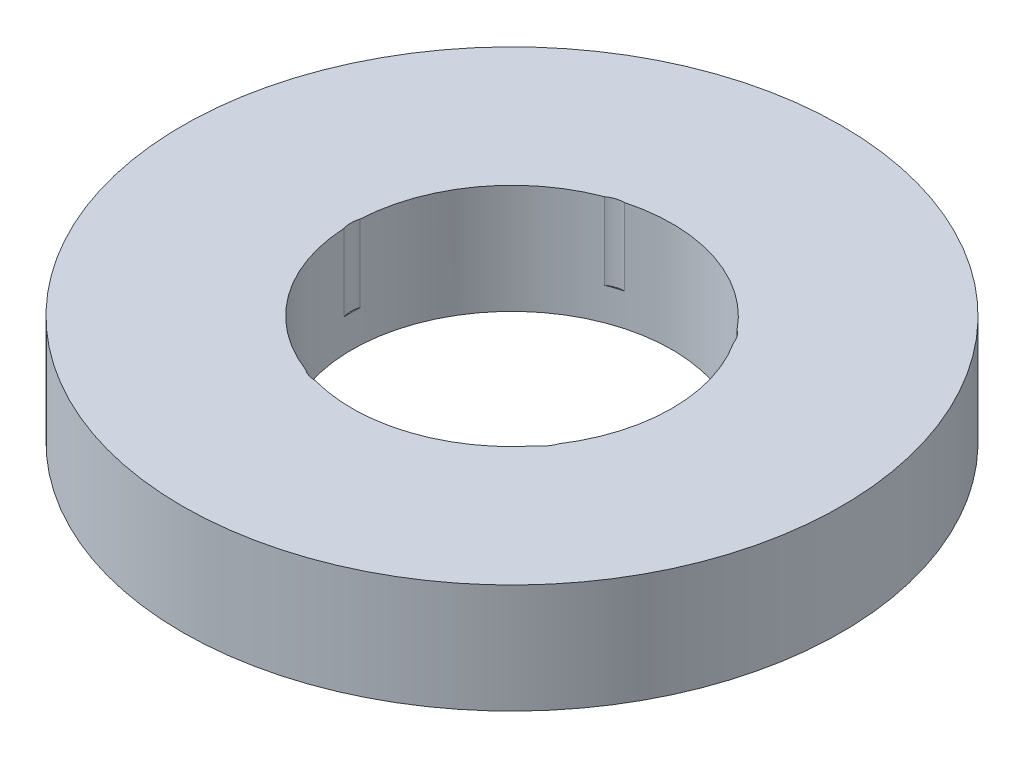
ISO-10303-21;
HEADER;
FILE_DESCRIPTION(('STEP AP214'),'2;1');
FILE_NAME('part.step','',(''),(''),'','','');
FILE_SCHEMA(('AUTOMOTIVE_DESIGN { 1 0 10303 214 1 1 1 1 }'));
ENDSEC;
DATA;
#1=APPLICATION_CONTEXT('core data for automotive mechanical design processes');
#2=APPLICATION_PROTOCOL_DEFINITION('international standard','automotive_design',2000,#1);
#3=PRODUCT_CONTEXT('',#1,'mechanical');
#4=PRODUCT('Part','Part','',(#3));
#5=PRODUCT_RELATED_PRODUCT_CATEGORY('part','',(#4));
#6=PRODUCT_DEFINITION_FORMATION('','',#4);
#7=PRODUCT_DEFINITION_CONTEXT('part definition',#1,'design');
#8=PRODUCT_DEFINITION('design','',#6,#7);
#9=PRODUCT_DEFINITION_SHAPE('','',#8);
#10=(LENGTH_UNIT() NAMED_UNIT(*) SI_UNIT(.MILLI.,.METRE.));
#11=(NAMED_UNIT(*) PLANE_ANGLE_UNIT() SI_UNIT($,.RADIAN.));
#12=(NAMED_UNIT(*) SI_UNIT($,.STERADIAN.) SOLID_ANGLE_UNIT());
#13=UNCERTAINTY_MEASURE_WITH_UNIT(LENGTH_MEASURE(1.E-05),#10,'distance_accuracy_value','');
#14=(GEOMETRIC_REPRESENTATION_CONTEXT(3) GLOBAL_UNCERTAINTY_ASSIGNED_CONTEXT((#13)) GLOBAL_UNIT_ASSIGNED_CONTEXT((#10,
#11,#12)) REPRESENTATION_CONTEXT('',''));
#15=CARTESIAN_POINT('',(0.,0.,0.));
#16=DIRECTION('',(0.,0.,1.));
#17=DIRECTION('',(1.,0.,0.));
#18=AXIS2_PLACEMENT_3D('',#15,#16,#17);
#19=CARTESIAN_POINT('',(0.,29.,0.));
#20=DIRECTION('',(0.,-1.,0.));
#21=DIRECTION('',(0.,0.,-1.));
#22=AXIS2_PLACEMENT_3D('',#19,#20,#21);
#23=CYLINDRICAL_SURFACE('',#22,87.5);
#24=CARTESIAN_POINT('',(0.,29.,0.));
#25=DIRECTION('',(0.,1.,0.));
#26=DIRECTION('',(0.,0.,1.));
#27=AXIS2_PLACEMENT_3D('',#24,#25,#26);
#28=CIRCLE('',#27,87.5);
#29=CARTESIAN_POINT('',(0.,29.,-87.5));
#30=VERTEX_POINT('',#29);
#31=EDGE_CURVE('E151',#30,#30,#28,.T.);
#32=CARTESIAN_POINT('',(0.,0.,0.));
#33=DIRECTION('',(0.,1.,0.));
#34=DIRECTION('',(0.,0.,1.));
#35=AXIS2_PLACEMENT_3D('',#32,#33,#34);
#36=CIRCLE('',#35,87.5);
#37=CARTESIAN_POINT('',(0.,0.,-87.5));
#38=VERTEX_POINT('',#37);
#39=EDGE_CURVE('E150',#38,#38,#36,.T.);
#40=CARTESIAN_POINT('',(0.,29.,-87.5));
#41=CARTESIAN_POINT('',(0.,28.6979166666667,-87.5));
#42=CARTESIAN_POINT('',(0.,28.3958333333333,-87.5));
#43=CARTESIAN_POINT('',(0.,27.7916666666667,-87.5));
#44=CARTESIAN_POINT('',(0.,27.4895833333333,-87.5));
#45=CARTESIAN_POINT('',(0.,26.8854166666667,-87.5));
#46=CARTESIAN_POINT('',(0.,26.5833333333333,-87.5));
#47=CARTESIAN_POINT('',(0.,25.9791666666667,-87.5));
#48=CARTESIAN_POINT('',(0.,25.6770833333333,-87.5));
#49=CARTESIAN_POINT('',(0.,25.0729166666667,-87.5));
#50=CARTESIAN_POINT('',(0.,24.7708333333333,-87.5));
#51=CARTESIAN_POINT('',(0.,24.1666666666667,-87.5));
#52=CARTESIAN_POINT('',(0.,23.8645833333333,-87.5));
#53=CARTESIAN_POINT('',(0.,23.2604166666667,-87.5));
#54=CARTESIAN_POINT('',(0.,22.9583333333333,-87.5));
#55=CARTESIAN_POINT('',(0.,22.3541666666667,-87.5));
#56=CARTESIAN_POINT('',(0.,22.0520833333333,-87.5));
#57=CARTESIAN_POINT('',(0.,21.4479166666667,-87.5));
#58=CARTESIAN_POINT('',(0.,21.1458333333333,-87.5));
#59=CARTESIAN_POINT('',(0.,20.5416666666667,-87.5));
#60=CARTESIAN_POINT('',(0.,20.2395833333333,-87.5));
#61=CARTESIAN_POINT('',(0.,19.6354166666667,-87.5));
#62=CARTESIAN_POINT('',(0.,19.3333333333333,-87.5));
#63=CARTESIAN_POINT('',(0.,18.7291666666667,-87.5));
#64=CARTESIAN_POINT('',(0.,18.4270833333333,-87.5));
#65=CARTESIAN_POINT('',(0.,17.8229166666667,-87.5));
#66=CARTESIAN_POINT('',(0.,17.5208333333333,-87.5));
#67=CARTESIAN_POINT('',(0.,16.9166666666667,-87.5));
#68=CARTESIAN_POINT('',(0.,16.6145833333333,-87.5));
#69=CARTESIAN_POINT('',(0.,16.0104166666667,-87.5));
#70=CARTESIAN_POINT('',(0.,15.7083333333333,-87.5));
#71=CARTESIAN_POINT('',(0.,15.1041666666667,-87.5));
#72=CARTESIAN_POINT('',(0.,14.8020833333333,-87.5));
#73=CARTESIAN_POINT('',(0.,14.1979166666667,-87.5));
#74=CARTESIAN_POINT('',(0.,13.8958333333333,-87.5));
#75=CARTESIAN_POINT('',(0.,13.2916666666667,-87.5));
#76=CARTESIAN_POINT('',(0.,12.9895833333333,-87.5));
#77=CARTESIAN_POINT('',(0.,12.3854166666667,-87.5));
#78=CARTESIAN_POINT('',(0.,12.0833333333333,-87.5));
#79=CARTESIAN_POINT('',(0.,11.4791666666667,-87.5));
#80=CARTESIAN_POINT('',(0.,11.1770833333333,-87.5));
#81=CARTESIAN_POINT('',(0.,10.5729166666667,-87.5));
#82=CARTESIAN_POINT('',(0.,10.2708333333333,-87.5));
#83=CARTESIAN_POINT('',(0.,9.66666666666667,-87.5));
#84=CARTESIAN_POINT('',(0.,9.36458333333333,-87.5));
#85=CARTESIAN_POINT('',(0.,8.76041666666667,-87.5));
#86=CARTESIAN_POINT('',(0.,8.45833333333333,-87.5));
#87=CARTESIAN_POINT('',(0.,7.85416666666667,-87.5));
#88=CARTESIAN_POINT('',(0.,7.55208333333333,-87.5));
#89=CARTESIAN_POINT('',(0.,6.94791666666667,-87.5));
#90=CARTESIAN_POINT('',(0.,6.64583333333333,-87.5));
#91=CARTESIAN_POINT('',(0.,6.04166666666667,-87.5));
#92=CARTESIAN_POINT('',(0.,5.73958333333333,-87.5));
#93=CARTESIAN_POINT('',(0.,5.13541666666667,-87.5));
#94=CARTESIAN_POINT('',(0.,4.83333333333333,-87.5));
#95=CARTESIAN_POINT('',(0.,4.22916666666667,-87.5));
#96=CARTESIAN_POINT('',(0.,3.92708333333333,-87.5));
#97=CARTESIAN_POINT('',(0.,3.32291666666667,-87.5));
#98=CARTESIAN_POINT('',(0.,3.02083333333333,-87.5));
#99=CARTESIAN_POINT('',(0.,2.41666666666667,-87.5));
#100=CARTESIAN_POINT('',(0.,2.11458333333333,-87.5));
#101=CARTESIAN_POINT('',(0.,1.51041666666667,-87.5));
#102=CARTESIAN_POINT('',(0.,1.20833333333333,-87.5));
#103=CARTESIAN_POINT('',(0.,0.604166666666667,-87.5));
#104=CARTESIAN_POINT('',(0.,0.302083333333333,-87.5));
#105=CARTESIAN_POINT('',(0.,0.,-87.5));
#106=B_SPLINE_CURVE_WITH_KNOTS('',3,(#40,#41,#42,#43,#44,#45,#46,#47,#48,#49,#50,#51,#52,#53,
#54,#55,#56,#57,#58,#59,#60,#61,#62,#63,#64,#65,#66,#67,#68,#69,#70,#71,#72,#73,#74,#75,#76,#77,
#78,#79,#80,#81,#82,#83,#84,#85,#86,#87,#88,#89,#90,#91,#92,#93,#94,#95,#96,#97,#98,#99,#100,
#101,#102,#103,#104,#105),.UNSPECIFIED.,.F.,.F.,(4,2,2,2,2,2,2,2,2,2,2,2,2,2,2,2,2,2,2,2,2,2,2,
2,2,2,2,2,2,2,2,2,4),(0.,0.906249999999997,1.8125,2.71875,3.625,4.53125,5.4375,6.34375,7.25,
8.15625,9.0625,9.96875,10.875,11.78125,12.6875,13.59375,14.5,15.40625,16.3125,17.21875,18.125,
19.03125,19.9375,20.84375,21.75,22.65625,23.5625,24.46875,25.375,26.28125,27.1875,28.09375,29.),.UNSPECIFIED.);
#107=EDGE_CURVE('BSEAM39',#30,#38,#106,.T.);
#108=ORIENTED_EDGE('',*,*,#31,.F.);
#109=ORIENTED_EDGE('',*,*,#39,.T.);
#110=ORIENTED_EDGE('',*,*,#107,.T.);
#111=ORIENTED_EDGE('',*,*,#107,.F.);
#112=EDGE_LOOP('',(#108,#110,#109,#111));
#113=FACE_BOUND('',#112,.T.);
#114=ADVANCED_FACE('F39',(#113),#23,.T.);
#115=CARTESIAN_POINT('',(0.,29.,0.));
#116=DIRECTION('',(0.,1.,0.));
#117=DIRECTION('',(0.,0.,1.));
#118=AXIS2_PLACEMENT_3D('',#115,#116,#117);
#119=PLANE('',#118);
#120=CARTESIAN_POINT('',(-11.0575258111567,29.,-34.0315651508861));
#121=DIRECTION('',(0.,1.,0.));
#122=DIRECTION('',(-0.95105651629515,0.,0.309016994374958));
#123=AXIS2_PLACEMENT_3D('',#120,#121,#122);
#124=CIRCLE('',#123,6.99416416466977);
#125=CARTESIAN_POINT('',(-11.0972423041203,29.,-41.0256165492201));
#126=VERTEX_POINT('',#125);
#127=CARTESIAN_POINT('',(-15.1363947591085,29.,-39.7132163605069));
#128=VERTEX_POINT('',#127);
#129=EDGE_CURVE('E196',#126,#128,#124,.T.);
#130=ORIENTED_EDGE('',*,*,#129,.F.);
#131=CARTESIAN_POINT('',(0.,29.,0.));
#132=DIRECTION('',(0.,1.,0.));
#133=DIRECTION('',(0.,0.,1.));
#134=AXIS2_PLACEMENT_3D('',#131,#132,#133);
#135=CIRCLE('',#134,42.5);
#136=CARTESIAN_POINT('',(33.092109988567,29.,-26.6676256255517));
#137=VERTEX_POINT('',#136);
#138=EDGE_CURVE('E156',#137,#126,#135,.T.);
#139=ORIENTED_EDGE('',*,*,#138,.F.);
#140=CARTESIAN_POINT('',(28.9489784050863,29.,-21.0326639536044));
#141=DIRECTION('',(0.,1.,0.));
#142=DIRECTION('',(-0.58778525229248,0.,-0.809016994374942));
#143=AXIS2_PLACEMENT_3D('',#140,#141,#142);
#144=CIRCLE('',#143,6.99416416466977);
#145=CARTESIAN_POINT('',(35.5884434914923,29.,-23.2317173246589));
#146=VERTEX_POINT('',#145);
#147=EDGE_CURVE('E254',#146,#137,#144,.T.);
#148=ORIENTED_EDGE('',*,*,#147,.F.);
#149=CARTESIAN_POINT('',(35.5884434914927,29.,23.2317173246584));
#150=VERTEX_POINT('',#149);
#151=EDGE_CURVE('E153',#150,#146,#135,.T.);
#152=ORIENTED_EDGE('',*,*,#151,.F.);
#153=CARTESIAN_POINT('',(28.9489784050866,29.,21.032663953604));
#154=DIRECTION('',(0.,1.,0.));
#155=DIRECTION('',(0.587785252292469,0.,-0.809016994374951));
#156=AXIS2_PLACEMENT_3D('',#153,#154,#155);
#157=CIRCLE('',#156,6.99416416466977);
#158=CARTESIAN_POINT('',(33.0921099885674,29.,26.6676256255513));
#159=VERTEX_POINT('',#158);
#160=EDGE_CURVE('E248',#159,#150,#157,.T.);
#161=ORIENTED_EDGE('',*,*,#160,.F.);
#162=CARTESIAN_POINT('',(-11.0972423041197,29.,41.0256165492203));
#163=VERTEX_POINT('',#162);
#164=EDGE_CURVE('E140',#163,#159,#135,.T.);
#165=ORIENTED_EDGE('',*,*,#164,.F.);
#166=CARTESIAN_POINT('',(-11.0575258111562,29.,34.0315651508863));
#167=DIRECTION('',(0.,1.,0.));
#168=DIRECTION('',(0.951056516295155,0.,0.309016994374945));
#169=AXIS2_PLACEMENT_3D('',#166,#167,#168);
#170=CIRCLE('',#169,6.99416416466977);
#171=CARTESIAN_POINT('',(-15.136394759108,29.,39.7132163605071));
#172=VERTEX_POINT('',#171);
#173=EDGE_CURVE('E117',#172,#163,#170,.T.);
#174=ORIENTED_EDGE('',*,*,#173,.F.);
#175=CARTESIAN_POINT('',(-42.4469164168318,29.,2.12350811217969));
#176=VERTEX_POINT('',#175);
#177=EDGE_CURVE('E133',#176,#172,#135,.T.);
#178=ORIENTED_EDGE('',*,*,#177,.F.);
#179=CARTESIAN_POINT('',(-35.7829051878604,29.,0.));
#180=DIRECTION('',(0.,1.,0.));
#181=DIRECTION('',(0.,0.,1.));
#182=AXIS2_PLACEMENT_3D('',#179,#180,#181);
#183=CIRCLE('',#182,6.99416416466977);
#184=CARTESIAN_POINT('',(-42.4469164168318,29.,-2.12350811217969));
#185=VERTEX_POINT('',#184);
#186=EDGE_CURVE('E170',#185,#176,#183,.T.);
#187=ORIENTED_EDGE('',*,*,#186,.F.);
#188=EDGE_CURVE('E149',#128,#185,#135,.T.);
#189=ORIENTED_EDGE('',*,*,#188,.F.);
#190=EDGE_LOOP('',(#130,#139,#148,#152,#161,#165,#174,#178,#187,#189));
#191=FACE_BOUND('',#190,.T.);
#192=ORIENTED_EDGE('',*,*,#31,.T.);
#193=EDGE_LOOP('',(#192));
#194=FACE_BOUND('',#193,.T.);
#195=ADVANCED_FACE('F131',(#191,#194),#119,.T.);
#196=CARTESIAN_POINT('',(0.,0.,0.));
#197=DIRECTION('',(0.,1.,0.));
#198=DIRECTION('',(0.,0.,1.));
#199=AXIS2_PLACEMENT_3D('',#196,#197,#198);
#200=PLANE('',#199);
#201=CARTESIAN_POINT('',(0.,0.,0.));
#202=DIRECTION('',(0.,1.,0.));
#203=DIRECTION('',(0.,0.,1.));
#204=AXIS2_PLACEMENT_3D('',#201,#202,#203);
#205=CIRCLE('',#204,42.5);
#206=CARTESIAN_POINT('',(0.,0.,42.5));
#207=VERTEX_POINT('',#206);
#208=EDGE_CURVE('E160',#207,#207,#205,.T.);
#209=ORIENTED_EDGE('',*,*,#208,.T.);
#210=EDGE_LOOP('',(#209));
#211=FACE_BOUND('',#210,.T.);
#212=ORIENTED_EDGE('',*,*,#39,.F.);
#213=EDGE_LOOP('',(#212));
#214=FACE_BOUND('',#213,.T.);
#215=ADVANCED_FACE('F212',(#211,#214),#200,.F.);
#216=CARTESIAN_POINT('',(0.,29.,0.));
#217=DIRECTION('',(0.,-1.,0.));
#218=DIRECTION('',(0.,0.,-1.));
#219=AXIS2_PLACEMENT_3D('',#216,#217,#218);
#220=CYLINDRICAL_SURFACE('',#219,42.5);
#221=DIRECTION('',(0.,1.,0.));
#222=VECTOR('',#221,1.);
#223=CARTESIAN_POINT('',(-11.0972423041203,18.8211931493955,-41.0256165492201));
#224=LINE('',#223,#222);
#225=CARTESIAN_POINT('',(-11.0972423041203,8.64238629879107,-41.0256165492201));
#226=VERTEX_POINT('',#225);
#227=EDGE_CURVE('E11',#226,#126,#224,.T.);
#228=ORIENTED_EDGE('',*,*,#227,.F.);
#229=CARTESIAN_POINT('',(0.,8.64238629879107,0.));
#230=DIRECTION('',(0.,1.,0.));
#231=DIRECTION('',(0.,0.,1.));
#232=AXIS2_PLACEMENT_3D('',#229,#230,#231);
#233=CIRCLE('',#232,42.5);
#234=CARTESIAN_POINT('',(-15.1363947591085,8.64238629879107,-39.7132163605069));
#235=VERTEX_POINT('',#234);
#236=EDGE_CURVE('E193',#226,#235,#233,.T.);
#237=ORIENTED_EDGE('',*,*,#236,.T.);
#238=DIRECTION('',(0.,1.,0.));
#239=VECTOR('',#238,1.);
#240=CARTESIAN_POINT('',(-15.1363947591085,18.8211931493955,-39.7132163605069));
#241=LINE('',#240,#239);
#242=EDGE_CURVE('E46',#128,#235,#241,.F.);
#243=ORIENTED_EDGE('',*,*,#242,.F.);
#244=ORIENTED_EDGE('',*,*,#188,.T.);
#245=DIRECTION('',(0.,1.,0.));
#246=VECTOR('',#245,1.);
#247=CARTESIAN_POINT('',(-42.4469164168318,18.8211931493955,-2.12350811217968));
#248=LINE('',#247,#246);
#249=CARTESIAN_POINT('',(-42.4469164168318,8.64238629879107,-2.12350811217969));
#250=VERTEX_POINT('',#249);
#251=EDGE_CURVE('E174',#250,#185,#248,.T.);
#252=ORIENTED_EDGE('',*,*,#251,.F.);
#253=CARTESIAN_POINT('',(0.,8.64238629879107,0.));
#254=DIRECTION('',(0.,1.,0.));
#255=DIRECTION('',(0.,0.,1.));
#256=AXIS2_PLACEMENT_3D('',#253,#254,#255);
#257=CIRCLE('',#256,42.5);
#258=CARTESIAN_POINT('',(-42.4469164168318,8.64238629879107,2.12350811217969));
#259=VERTEX_POINT('',#258);
#260=EDGE_CURVE('E171',#250,#259,#257,.T.);
#261=ORIENTED_EDGE('',*,*,#260,.T.);
#262=DIRECTION('',(0.,1.,0.));
#263=VECTOR('',#262,1.);
#264=CARTESIAN_POINT('',(-42.4469164168318,18.8211931493955,2.12350811217968));
#265=LINE('',#264,#263);
#266=EDGE_CURVE('E148',#176,#259,#265,.F.);
#267=ORIENTED_EDGE('',*,*,#266,.F.);
#268=ORIENTED_EDGE('',*,*,#177,.T.);
#269=DIRECTION('',(0.,1.,0.));
#270=VECTOR('',#269,1.);
#271=CARTESIAN_POINT('',(-15.136394759108,18.8211931493955,39.7132163605071));
#272=LINE('',#271,#270);
#273=CARTESIAN_POINT('',(-15.136394759108,8.64238629879107,39.7132163605071));
#274=VERTEX_POINT('',#273);
#275=EDGE_CURVE('E111',#274,#172,#272,.T.);
#276=ORIENTED_EDGE('',*,*,#275,.F.);
#277=CARTESIAN_POINT('',(0.,8.64238629879107,0.));
#278=DIRECTION('',(0.,1.,0.));
#279=DIRECTION('',(0.,0.,1.));
#280=AXIS2_PLACEMENT_3D('',#277,#278,#279);
#281=CIRCLE('',#280,42.5);
#282=CARTESIAN_POINT('',(-11.0972423041197,8.64238629879107,41.0256165492203));
#283=VERTEX_POINT('',#282);
#284=EDGE_CURVE('E180',#274,#283,#281,.T.);
#285=ORIENTED_EDGE('',*,*,#284,.T.);
#286=DIRECTION('',(0.,1.,0.));
#287=VECTOR('',#286,1.);
#288=CARTESIAN_POINT('',(-11.0972423041198,18.8211931493955,41.0256165492203));
#289=LINE('',#288,#287);
#290=EDGE_CURVE('E124',#163,#283,#289,.F.);
#291=ORIENTED_EDGE('',*,*,#290,.F.);
#292=ORIENTED_EDGE('',*,*,#164,.T.);
#293=DIRECTION('',(0.,1.,0.));
#294=VECTOR('',#293,1.);
#295=CARTESIAN_POINT('',(33.0921099885674,18.8211931493955,26.6676256255513));
#296=LINE('',#295,#294);
#297=CARTESIAN_POINT('',(33.0921099885674,8.64238629879107,26.6676256255513));
#298=VERTEX_POINT('',#297);
#299=EDGE_CURVE('E183',#298,#159,#296,.T.);
#300=ORIENTED_EDGE('',*,*,#299,.F.);
#301=CARTESIAN_POINT('',(0.,8.64238629879107,0.));
#302=DIRECTION('',(0.,1.,0.));
#303=DIRECTION('',(0.,0.,1.));
#304=AXIS2_PLACEMENT_3D('',#301,#302,#303);
#305=CIRCLE('',#304,42.5);
#306=CARTESIAN_POINT('',(35.5884434914927,8.64238629879107,23.2317173246584));
#307=VERTEX_POINT('',#306);
#308=EDGE_CURVE('E123',#298,#307,#305,.T.);
#309=ORIENTED_EDGE('',*,*,#308,.T.);
#310=DIRECTION('',(0.,1.,0.));
#311=VECTOR('',#310,1.);
#312=CARTESIAN_POINT('',(35.5884434914927,18.8211931493955,23.2317173246584));
#313=LINE('',#312,#311);
#314=EDGE_CURVE('E185',#150,#307,#313,.F.);
#315=ORIENTED_EDGE('',*,*,#314,.F.);
#316=ORIENTED_EDGE('',*,*,#151,.T.);
#317=DIRECTION('',(0.,1.,0.));
#318=VECTOR('',#317,1.);
#319=CARTESIAN_POINT('',(35.5884434914923,18.8211931493955,-23.2317173246589));
#320=LINE('',#319,#318);
#321=CARTESIAN_POINT('',(35.5884434914923,8.64238629879107,-23.2317173246589));
#322=VERTEX_POINT('',#321);
#323=EDGE_CURVE('E195',#322,#146,#320,.T.);
#324=ORIENTED_EDGE('',*,*,#323,.F.);
#325=CARTESIAN_POINT('',(0.,8.64238629879107,0.));
#326=DIRECTION('',(0.,1.,0.));
#327=DIRECTION('',(0.,0.,1.));
#328=AXIS2_PLACEMENT_3D('',#325,#326,#327);
#329=CIRCLE('',#328,42.5);
#330=CARTESIAN_POINT('',(33.092109988567,8.64238629879107,-26.6676256255517));
#331=VERTEX_POINT('',#330);
#332=EDGE_CURVE('E190',#322,#331,#329,.T.);
#333=ORIENTED_EDGE('',*,*,#332,.T.);
#334=DIRECTION('',(0.,1.,0.));
#335=VECTOR('',#334,1.);
#336=CARTESIAN_POINT('',(33.092109988567,18.8211931493955,-26.6676256255517));
#337=LINE('',#336,#335);
#338=EDGE_CURVE('E189',#137,#331,#337,.F.);
#339=ORIENTED_EDGE('',*,*,#338,.F.);
#340=ORIENTED_EDGE('',*,*,#138,.T.);
#341=EDGE_LOOP('',(#228,#237,#243,#244,#252,#261,#267,#268,#276,#285,#291,#292,#300,#309,#315,
#316,#324,#333,#339,#340));
#342=FACE_BOUND('',#341,.T.);
#343=ORIENTED_EDGE('',*,*,#208,.F.);
#344=EDGE_LOOP('',(#343));
#345=FACE_BOUND('',#344,.T.);
#346=ADVANCED_FACE('F142',(#342,#345),#220,.F.);
#347=CARTESIAN_POINT('',(-35.7829051878604,8.64238629879107,0.));
#348=DIRECTION('',(0.,1.,0.));
#349=DIRECTION('',(0.,0.,1.));
#350=AXIS2_PLACEMENT_3D('',#347,#348,#349);
#351=CYLINDRICAL_SURFACE('',#350,6.99416416466977);
#352=ORIENTED_EDGE('',*,*,#251,.T.);
#353=ORIENTED_EDGE('',*,*,#186,.T.);
#354=ORIENTED_EDGE('',*,*,#266,.T.);
#355=CARTESIAN_POINT('',(-35.7829051878604,8.64238629879107,0.));
#356=DIRECTION('',(0.,1.,0.));
#357=DIRECTION('',(0.,0.,1.));
#358=AXIS2_PLACEMENT_3D('',#355,#356,#357);
#359=CIRCLE('',#358,6.99416416466977);
#360=EDGE_CURVE('E163',#250,#259,#359,.T.);
#361=ORIENTED_EDGE('',*,*,#360,.F.);
#362=EDGE_LOOP('',(#352,#353,#354,#361));
#363=FACE_BOUND('',#362,.T.);
#364=ADVANCED_FACE('F221',(#363),#351,.F.);
#365=CARTESIAN_POINT('',(-35.7829051878604,8.64238629879107,0.));
#366=DIRECTION('',(0.,1.,0.));
#367=DIRECTION('',(0.,0.,1.));
#368=AXIS2_PLACEMENT_3D('',#365,#366,#367);
#369=PLANE('',#368);
#370=ORIENTED_EDGE('',*,*,#360,.T.);
#371=ORIENTED_EDGE('',*,*,#260,.F.);
#372=EDGE_LOOP('',(#370,#371));
#373=FACE_BOUND('',#372,.T.);
#374=ADVANCED_FACE('F227',(#373),#369,.T.);
#375=CARTESIAN_POINT('',(-11.0575258111562,8.64238629879107,34.0315651508863));
#376=DIRECTION('',(0.,1.,0.));
#377=DIRECTION('',(0.,0.,1.));
#378=AXIS2_PLACEMENT_3D('',#375,#376,#377);
#379=CYLINDRICAL_SURFACE('',#378,6.99416416466977);
#380=ORIENTED_EDGE('',*,*,#275,.T.);
#381=ORIENTED_EDGE('',*,*,#173,.T.);
#382=ORIENTED_EDGE('',*,*,#290,.T.);
#383=CARTESIAN_POINT('',(-11.0575258111562,8.64238629879107,34.0315651508863));
#384=DIRECTION('',(0.,1.,0.));
#385=DIRECTION('',(0.951056516295155,0.,0.309016994374945));
#386=AXIS2_PLACEMENT_3D('',#383,#384,#385);
#387=CIRCLE('',#386,6.99416416466977);
#388=EDGE_CURVE('E119',#274,#283,#387,.T.);
#389=ORIENTED_EDGE('',*,*,#388,.F.);
#390=EDGE_LOOP('',(#380,#381,#382,#389));
#391=FACE_BOUND('',#390,.T.);
#392=ADVANCED_FACE('F116',(#391),#379,.F.);
#393=CARTESIAN_POINT('',(-11.0575258111562,8.64238629879107,34.0315651508863));
#394=DIRECTION('',(0.,1.,0.));
#395=DIRECTION('',(0.951056516295155,0.,0.309016994374945));
#396=AXIS2_PLACEMENT_3D('',#393,#394,#395);
#397=PLANE('',#396);
#398=ORIENTED_EDGE('',*,*,#388,.T.);
#399=ORIENTED_EDGE('',*,*,#284,.F.);
#400=EDGE_LOOP('',(#398,#399));
#401=FACE_BOUND('',#400,.T.);
#402=ADVANCED_FACE('F234',(#401),#397,.T.);
#403=CARTESIAN_POINT('',(28.9489784050866,8.64238629879107,21.032663953604));
#404=DIRECTION('',(0.,1.,0.));
#405=DIRECTION('',(0.,0.,1.));
#406=AXIS2_PLACEMENT_3D('',#403,#404,#405);
#407=CYLINDRICAL_SURFACE('',#406,6.99416416466977);
#408=ORIENTED_EDGE('',*,*,#299,.T.);
#409=ORIENTED_EDGE('',*,*,#160,.T.);
#410=ORIENTED_EDGE('',*,*,#314,.T.);
#411=CARTESIAN_POINT('',(28.9489784050866,8.64238629879107,21.032663953604));
#412=DIRECTION('',(0.,1.,0.));
#413=DIRECTION('',(0.587785252292469,0.,-0.809016994374951));
#414=AXIS2_PLACEMENT_3D('',#411,#412,#413);
#415=CIRCLE('',#414,6.99416416466977);
#416=EDGE_CURVE('E137',#298,#307,#415,.T.);
#417=ORIENTED_EDGE('',*,*,#416,.F.);
#418=EDGE_LOOP('',(#408,#409,#410,#417));
#419=FACE_BOUND('',#418,.T.);
#420=ADVANCED_FACE('F240',(#419),#407,.F.);
#421=CARTESIAN_POINT('',(28.9489784050866,8.64238629879107,21.032663953604));
#422=DIRECTION('',(0.,1.,0.));
#423=DIRECTION('',(0.587785252292469,0.,-0.809016994374951));
#424=AXIS2_PLACEMENT_3D('',#421,#422,#423);
#425=PLANE('',#424);
#426=ORIENTED_EDGE('',*,*,#416,.T.);
#427=ORIENTED_EDGE('',*,*,#308,.F.);
#428=EDGE_LOOP('',(#426,#427));
#429=FACE_BOUND('',#428,.T.);
#430=ADVANCED_FACE('F245',(#429),#425,.T.);
#431=CARTESIAN_POINT('',(28.9489784050863,8.64238629879107,-21.0326639536044));
#432=DIRECTION('',(0.,1.,0.));
#433=DIRECTION('',(0.,0.,1.));
#434=AXIS2_PLACEMENT_3D('',#431,#432,#433);
#435=CYLINDRICAL_SURFACE('',#434,6.99416416466977);
#436=ORIENTED_EDGE('',*,*,#323,.T.);
#437=ORIENTED_EDGE('',*,*,#147,.T.);
#438=ORIENTED_EDGE('',*,*,#338,.T.);
#439=CARTESIAN_POINT('',(28.9489784050863,8.64238629879107,-21.0326639536044));
#440=DIRECTION('',(0.,1.,0.));
#441=DIRECTION('',(-0.58778525229248,0.,-0.809016994374942));
#442=AXIS2_PLACEMENT_3D('',#439,#440,#441);
#443=CIRCLE('',#442,6.99416416466977);
#444=EDGE_CURVE('E56',#322,#331,#443,.T.);
#445=ORIENTED_EDGE('',*,*,#444,.F.);
#446=EDGE_LOOP('',(#436,#437,#438,#445));
#447=FACE_BOUND('',#446,.T.);
#448=ADVANCED_FACE('F264',(#447),#435,.F.);
#449=CARTESIAN_POINT('',(28.9489784050863,8.64238629879107,-21.0326639536044));
#450=DIRECTION('',(0.,1.,0.));
#451=DIRECTION('',(-0.58778525229248,0.,-0.809016994374942));
#452=AXIS2_PLACEMENT_3D('',#449,#450,#451);
#453=PLANE('',#452);
#454=ORIENTED_EDGE('',*,*,#444,.T.);
#455=ORIENTED_EDGE('',*,*,#332,.F.);
#456=EDGE_LOOP('',(#454,#455));
#457=FACE_BOUND('',#456,.T.);
#458=ADVANCED_FACE('F202',(#457),#453,.T.);
#459=CARTESIAN_POINT('',(-11.0575258111567,8.64238629879107,-34.0315651508861));
#460=DIRECTION('',(0.,1.,0.));
#461=DIRECTION('',(0.,0.,1.));
#462=AXIS2_PLACEMENT_3D('',#459,#460,#461);
#463=CYLINDRICAL_SURFACE('',#462,6.99416416466977);
#464=ORIENTED_EDGE('',*,*,#227,.T.);
#465=ORIENTED_EDGE('',*,*,#129,.T.);
#466=ORIENTED_EDGE('',*,*,#242,.T.);
#467=CARTESIAN_POINT('',(-11.0575258111567,8.64238629879107,-34.0315651508861));
#468=DIRECTION('',(0.,1.,0.));
#469=DIRECTION('',(-0.95105651629515,0.,0.309016994374958));
#470=AXIS2_PLACEMENT_3D('',#467,#468,#469);
#471=CIRCLE('',#470,6.99416416466977);
#472=EDGE_CURVE('E55',#226,#235,#471,.T.);
#473=ORIENTED_EDGE('',*,*,#472,.F.);
#474=EDGE_LOOP('',(#464,#465,#466,#473));
#475=FACE_BOUND('',#474,.T.);
#476=ADVANCED_FACE('F197',(#475),#463,.F.);
#477=CARTESIAN_POINT('',(-11.0575258111567,8.64238629879107,-34.0315651508861));
#478=DIRECTION('',(0.,1.,0.));
#479=DIRECTION('',(-0.95105651629515,0.,0.309016994374958));
#480=AXIS2_PLACEMENT_3D('',#477,#478,#479);
#481=PLANE('',#480);
#482=ORIENTED_EDGE('',*,*,#472,.T.);
#483=ORIENTED_EDGE('',*,*,#236,.F.);
#484=EDGE_LOOP('',(#482,#483));
#485=FACE_BOUND('',#484,.T.);
#486=ADVANCED_FACE('F200',(#485),#481,.T.);
#487=CLOSED_SHELL('',(#114,#195,#215,#346,#364,#374,#392,#402,#420,#430,#448,#458,#476,#486));
#488=MANIFOLD_SOLID_BREP('B2',#487);
#489=ADVANCED_BREP_SHAPE_REPRESENTATION('',(#18,#488),#14);
#490=SHAPE_DEFINITION_REPRESENTATION(#9,#489);
ENDSEC;
END-ISO-10303-21;
